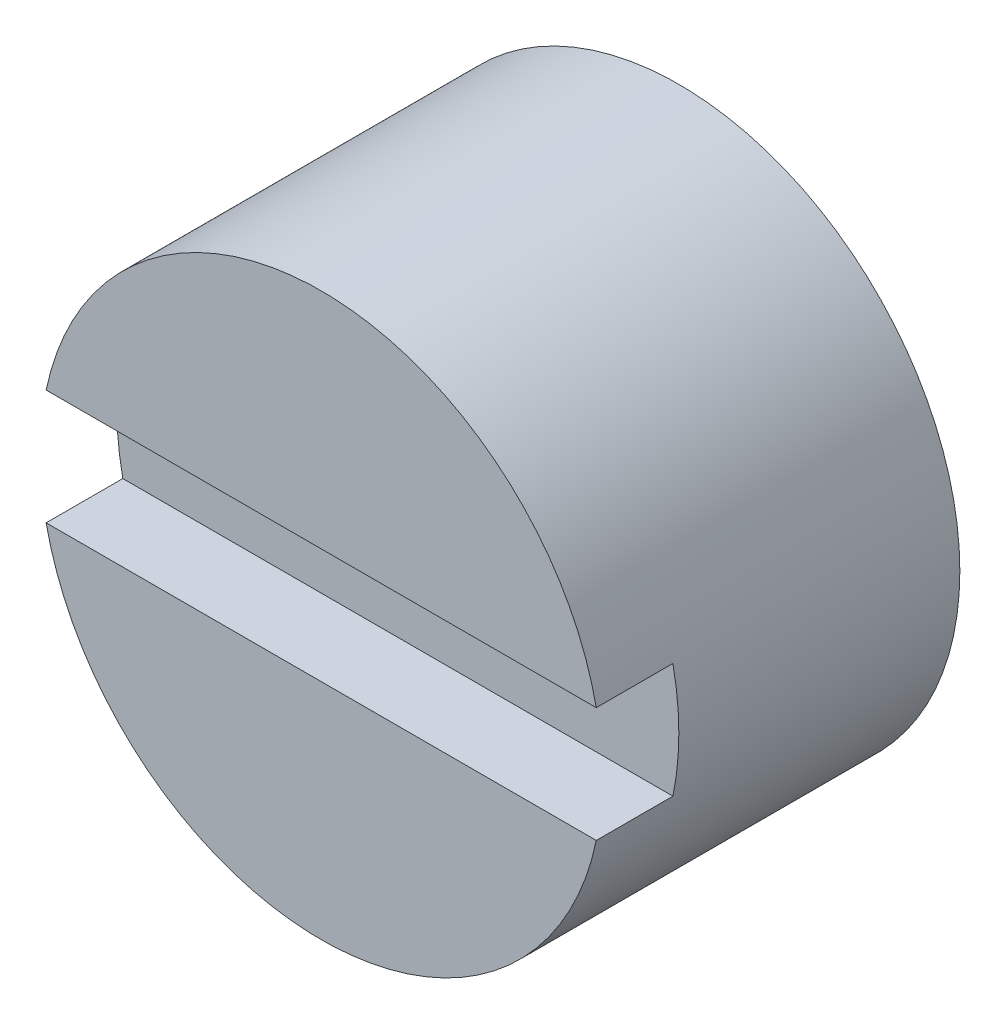
ISO-10303-21;
HEADER;
FILE_DESCRIPTION(('STEP AP214'),'2;1');
FILE_NAME('part.step','',(''),(''),'','','');
FILE_SCHEMA(('AUTOMOTIVE_DESIGN { 1 0 10303 214 1 1 1 1 }'));
ENDSEC;
DATA;
#1=APPLICATION_CONTEXT('core data for automotive mechanical design processes');
#2=APPLICATION_PROTOCOL_DEFINITION('international standard','automotive_design',2000,#1);
#3=PRODUCT_CONTEXT('',#1,'mechanical');
#4=PRODUCT('Part','Part','',(#3));
#5=PRODUCT_RELATED_PRODUCT_CATEGORY('part','',(#4));
#6=PRODUCT_DEFINITION_FORMATION('','',#4);
#7=PRODUCT_DEFINITION_CONTEXT('part definition',#1,'design');
#8=PRODUCT_DEFINITION('design','',#6,#7);
#9=PRODUCT_DEFINITION_SHAPE('','',#8);
#10=(LENGTH_UNIT() NAMED_UNIT(*) SI_UNIT(.MILLI.,.METRE.));
#11=(NAMED_UNIT(*) PLANE_ANGLE_UNIT() SI_UNIT($,.RADIAN.));
#12=(NAMED_UNIT(*) SI_UNIT($,.STERADIAN.) SOLID_ANGLE_UNIT());
#13=UNCERTAINTY_MEASURE_WITH_UNIT(LENGTH_MEASURE(1.E-05),#10,'distance_accuracy_value','');
#14=(GEOMETRIC_REPRESENTATION_CONTEXT(3) GLOBAL_UNCERTAINTY_ASSIGNED_CONTEXT((#13)) GLOBAL_UNIT_ASSIGNED_CONTEXT((#10,
#11,#12)) REPRESENTATION_CONTEXT('',''));
#15=CARTESIAN_POINT('',(0.,0.,0.));
#16=DIRECTION('',(0.,0.,1.));
#17=DIRECTION('',(1.,0.,0.));
#18=AXIS2_PLACEMENT_3D('',#15,#16,#17);
#19=CARTESIAN_POINT('',(8.5,5.23,17.69));
#20=DIRECTION('',(0.,0.,1.));
#21=DIRECTION('',(1.,0.,0.));
#22=AXIS2_PLACEMENT_3D('',#19,#20,#21);
#23=PLANE('',#22);
#24=DIRECTION('',(1.,0.,0.));
#25=VECTOR('',#24,1.);
#26=CARTESIAN_POINT('',(7.423257226632,5.455,17.69));
#27=LINE('',#26,#25);
#28=CARTESIAN_POINT('',(7.4232572266321,5.45499999999999,17.69));
#29=VERTEX_POINT('',#28);
#30=CARTESIAN_POINT('',(9.5767427733679,5.45499999999999,17.69));
#31=VERTEX_POINT('',#30);
#32=EDGE_CURVE('E55',#29,#31,#27,.T.);
#33=ORIENTED_EDGE('',*,*,#32,.T.);
#34=CARTESIAN_POINT('',(8.5,5.23,17.69));
#35=DIRECTION('',(0.,0.,1.));
#36=DIRECTION('',(1.,0.,0.));
#37=AXIS2_PLACEMENT_3D('',#34,#35,#36);
#38=CIRCLE('',#37,1.1);
#39=EDGE_CURVE('E20',#29,#31,#38,.F.);
#40=ORIENTED_EDGE('',*,*,#39,.F.);
#41=EDGE_LOOP('',(#33,#40));
#42=FACE_BOUND('',#41,.T.);
#43=ADVANCED_FACE('F17',(#42),#23,.T.);
#44=CARTESIAN_POINT('',(7.423257226632,5.455,17.69));
#45=DIRECTION('',(0.,1.,0.));
#46=DIRECTION('',(0.,0.,1.));
#47=AXIS2_PLACEMENT_3D('',#44,#45,#46);
#48=PLANE('',#47);
#49=DIRECTION('',(0.,0.,1.));
#50=VECTOR('',#49,1.);
#51=CARTESIAN_POINT('',(7.42325722663209,5.45499999999998,16.29));
#52=LINE('',#51,#50);
#53=CARTESIAN_POINT('',(7.4232572266321,5.45499999999999,17.39));
#54=VERTEX_POINT('',#53);
#55=EDGE_CURVE('E63',#54,#29,#52,.T.);
#56=ORIENTED_EDGE('',*,*,#55,.F.);
#57=DIRECTION('',(1.,0.,0.));
#58=VECTOR('',#57,1.);
#59=CARTESIAN_POINT('',(8.5,5.455,17.39));
#60=LINE('',#59,#58);
#61=CARTESIAN_POINT('',(9.5767427733679,5.45499999999999,17.39));
#62=VERTEX_POINT('',#61);
#63=EDGE_CURVE('E70',#62,#54,#60,.F.);
#64=ORIENTED_EDGE('',*,*,#63,.F.);
#65=DIRECTION('',(0.,0.,1.));
#66=VECTOR('',#65,1.);
#67=CARTESIAN_POINT('',(9.57674277336791,5.45499999999998,16.29));
#68=LINE('',#67,#66);
#69=EDGE_CURVE('E87',#31,#62,#68,.F.);
#70=ORIENTED_EDGE('',*,*,#69,.F.);
#71=ORIENTED_EDGE('',*,*,#32,.F.);
#72=EDGE_LOOP('',(#56,#64,#70,#71));
#73=FACE_BOUND('',#72,.T.);
#74=ADVANCED_FACE('F69',(#73),#48,.F.);
#75=CARTESIAN_POINT('',(8.5,5.23,17.69));
#76=DIRECTION('',(0.,0.,1.));
#77=DIRECTION('',(1.,0.,0.));
#78=AXIS2_PLACEMENT_3D('',#75,#76,#77);
#79=PLANE('',#78);
#80=DIRECTION('',(1.,0.,0.));
#81=VECTOR('',#80,1.);
#82=CARTESIAN_POINT('',(9.576742773368,5.005,17.69));
#83=LINE('',#82,#81);
#84=CARTESIAN_POINT('',(9.5767427733679,5.00500000000001,17.69));
#85=VERTEX_POINT('',#84);
#86=CARTESIAN_POINT('',(7.4232572266321,5.00500000000001,17.69));
#87=VERTEX_POINT('',#86);
#88=EDGE_CURVE('E77',#85,#87,#83,.F.);
#89=ORIENTED_EDGE('',*,*,#88,.T.);
#90=CARTESIAN_POINT('',(8.5,5.23,17.69));
#91=DIRECTION('',(0.,0.,1.));
#92=DIRECTION('',(1.,0.,0.));
#93=AXIS2_PLACEMENT_3D('',#90,#91,#92);
#94=CIRCLE('',#93,1.1);
#95=EDGE_CURVE('E82',#85,#87,#94,.F.);
#96=ORIENTED_EDGE('',*,*,#95,.F.);
#97=EDGE_LOOP('',(#89,#96));
#98=FACE_BOUND('',#97,.T.);
#99=ADVANCED_FACE('F96',(#98),#79,.T.);
#100=CARTESIAN_POINT('',(9.576742773368,5.005,17.69));
#101=DIRECTION('',(0.,-1.,0.));
#102=DIRECTION('',(0.,0.,-1.));
#103=AXIS2_PLACEMENT_3D('',#100,#101,#102);
#104=PLANE('',#103);
#105=DIRECTION('',(0.,0.,1.));
#106=VECTOR('',#105,1.);
#107=CARTESIAN_POINT('',(9.57674277336791,5.00500000000002,16.29));
#108=LINE('',#107,#106);
#109=CARTESIAN_POINT('',(9.5767427733679,5.00500000000001,17.39));
#110=VERTEX_POINT('',#109);
#111=EDGE_CURVE('E84',#110,#85,#108,.T.);
#112=ORIENTED_EDGE('',*,*,#111,.F.);
#113=DIRECTION('',(1.,0.,0.));
#114=VECTOR('',#113,1.);
#115=CARTESIAN_POINT('',(8.5,5.005,17.39));
#116=LINE('',#115,#114);
#117=CARTESIAN_POINT('',(7.4232572266321,5.00500000000001,17.39));
#118=VERTEX_POINT('',#117);
#119=EDGE_CURVE('E35',#118,#110,#116,.T.);
#120=ORIENTED_EDGE('',*,*,#119,.F.);
#121=DIRECTION('',(0.,0.,1.));
#122=VECTOR('',#121,1.);
#123=CARTESIAN_POINT('',(7.42325722663209,5.00500000000002,16.29));
#124=LINE('',#123,#122);
#125=EDGE_CURVE('E65',#87,#118,#124,.F.);
#126=ORIENTED_EDGE('',*,*,#125,.F.);
#127=ORIENTED_EDGE('',*,*,#88,.F.);
#128=EDGE_LOOP('',(#112,#120,#126,#127));
#129=FACE_BOUND('',#128,.T.);
#130=ADVANCED_FACE('F108',(#129),#104,.F.);
#131=CARTESIAN_POINT('',(8.5,5.23,16.29));
#132=DIRECTION('',(0.,0.,1.));
#133=DIRECTION('',(1.,0.,0.));
#134=AXIS2_PLACEMENT_3D('',#131,#132,#133);
#135=PLANE('',#134);
#136=CARTESIAN_POINT('',(8.5,5.23,16.29));
#137=DIRECTION('',(0.,0.,1.));
#138=DIRECTION('',(1.,0.,0.));
#139=AXIS2_PLACEMENT_3D('',#136,#137,#138);
#140=CIRCLE('',#139,1.1);
#141=CARTESIAN_POINT('',(9.6,5.23,16.29));
#142=VERTEX_POINT('',#141);
#143=EDGE_CURVE('E11',#142,#142,#140,.T.);
#144=ORIENTED_EDGE('',*,*,#143,.F.);
#145=EDGE_LOOP('',(#144));
#146=FACE_BOUND('',#145,.T.);
#147=ADVANCED_FACE('F103',(#146),#135,.F.);
#148=CARTESIAN_POINT('',(8.5,5.23,17.39));
#149=DIRECTION('',(0.,0.,1.));
#150=DIRECTION('',(1.,0.,0.));
#151=AXIS2_PLACEMENT_3D('',#148,#149,#150);
#152=PLANE('',#151);
#153=CARTESIAN_POINT('',(8.5,5.23,17.39));
#154=DIRECTION('',(0.,0.,1.));
#155=DIRECTION('',(1.,0.,0.));
#156=AXIS2_PLACEMENT_3D('',#153,#154,#155);
#157=CIRCLE('',#156,1.1);
#158=EDGE_CURVE('E26',#118,#54,#157,.F.);
#159=ORIENTED_EDGE('',*,*,#158,.F.);
#160=ORIENTED_EDGE('',*,*,#119,.T.);
#161=CARTESIAN_POINT('',(8.5,5.23,17.39));
#162=DIRECTION('',(0.,0.,1.));
#163=DIRECTION('',(1.,0.,0.));
#164=AXIS2_PLACEMENT_3D('',#161,#162,#163);
#165=CIRCLE('',#164,1.1);
#166=EDGE_CURVE('E75',#62,#110,#165,.F.);
#167=ORIENTED_EDGE('',*,*,#166,.F.);
#168=ORIENTED_EDGE('',*,*,#63,.T.);
#169=EDGE_LOOP('',(#159,#160,#167,#168));
#170=FACE_BOUND('',#169,.T.);
#171=ADVANCED_FACE('F73',(#170),#152,.T.);
#172=CARTESIAN_POINT('',(8.5,5.23,16.29));
#173=DIRECTION('',(0.,0.,1.));
#174=DIRECTION('',(1.,0.,0.));
#175=AXIS2_PLACEMENT_3D('',#172,#173,#174);
#176=CYLINDRICAL_SURFACE('',#175,1.1);
#177=ORIENTED_EDGE('',*,*,#143,.T.);
#178=EDGE_LOOP('',(#177));
#179=FACE_BOUND('',#178,.T.);
#180=ORIENTED_EDGE('',*,*,#158,.T.);
#181=ORIENTED_EDGE('',*,*,#55,.T.);
#182=ORIENTED_EDGE('',*,*,#39,.T.);
#183=ORIENTED_EDGE('',*,*,#69,.T.);
#184=ORIENTED_EDGE('',*,*,#166,.T.);
#185=ORIENTED_EDGE('',*,*,#111,.T.);
#186=ORIENTED_EDGE('',*,*,#95,.T.);
#187=ORIENTED_EDGE('',*,*,#125,.T.);
#188=EDGE_LOOP('',(#180,#181,#182,#183,#184,#185,#186,#187));
#189=FACE_BOUND('',#188,.T.);
#190=ADVANCED_FACE('F61',(#179,#189),#176,.T.);
#191=CLOSED_SHELL('',(#43,#74,#99,#130,#147,#171,#190));
#192=MANIFOLD_SOLID_BREP('B1',#191);
#193=ADVANCED_BREP_SHAPE_REPRESENTATION('',(#18,#192),#14);
#194=SHAPE_DEFINITION_REPRESENTATION(#9,#193);
ENDSEC;
END-ISO-10303-21;
